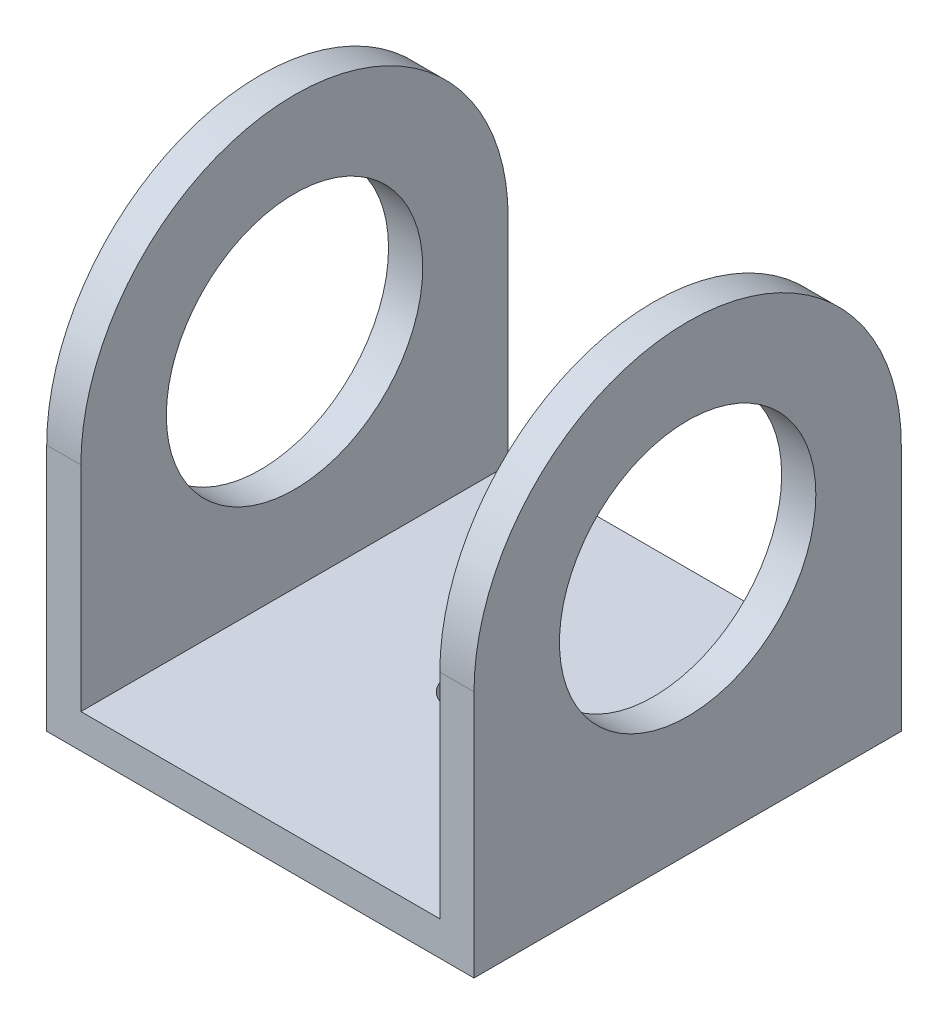
ISO-10303-21;
HEADER;
FILE_DESCRIPTION(('STEP AP214'),'2;1');
FILE_NAME('part.step','',(''),(''),'','','');
FILE_SCHEMA(('AUTOMOTIVE_DESIGN { 1 0 10303 214 1 1 1 1 }'));
ENDSEC;
DATA;
#1=APPLICATION_CONTEXT('core data for automotive mechanical design processes');
#2=APPLICATION_PROTOCOL_DEFINITION('international standard','automotive_design',2000,#1);
#3=PRODUCT_CONTEXT('',#1,'mechanical');
#4=PRODUCT('Part','Part','',(#3));
#5=PRODUCT_RELATED_PRODUCT_CATEGORY('part','',(#4));
#6=PRODUCT_DEFINITION_FORMATION('','',#4);
#7=PRODUCT_DEFINITION_CONTEXT('part definition',#1,'design');
#8=PRODUCT_DEFINITION('design','',#6,#7);
#9=PRODUCT_DEFINITION_SHAPE('','',#8);
#10=(LENGTH_UNIT() NAMED_UNIT(*) SI_UNIT(.MILLI.,.METRE.));
#11=(NAMED_UNIT(*) PLANE_ANGLE_UNIT() SI_UNIT($,.RADIAN.));
#12=(NAMED_UNIT(*) SI_UNIT($,.STERADIAN.) SOLID_ANGLE_UNIT());
#13=UNCERTAINTY_MEASURE_WITH_UNIT(LENGTH_MEASURE(1.E-05),#10,'distance_accuracy_value','');
#14=(GEOMETRIC_REPRESENTATION_CONTEXT(3) GLOBAL_UNCERTAINTY_ASSIGNED_CONTEXT((#13)) GLOBAL_UNIT_ASSIGNED_CONTEXT((#10,
#11,#12)) REPRESENTATION_CONTEXT('',''));
#15=CARTESIAN_POINT('',(0.,0.,0.));
#16=DIRECTION('',(0.,0.,1.));
#17=DIRECTION('',(1.,0.,0.));
#18=AXIS2_PLACEMENT_3D('',#15,#16,#17);
#19=CARTESIAN_POINT('',(25.4,4.064,25.4));
#20=DIRECTION('',(-1.,0.,0.));
#21=DIRECTION('',(0.,0.,1.));
#22=AXIS2_PLACEMENT_3D('',#19,#20,#21);
#23=PLANE('',#22);
#24=CARTESIAN_POINT('',(25.4,29.464,0.));
#25=DIRECTION('',(1.,0.,0.));
#26=DIRECTION('',(0.,0.,-1.));
#27=AXIS2_PLACEMENT_3D('',#24,#25,#26);
#28=CIRCLE('',#27,15.24);
#29=CARTESIAN_POINT('',(25.4,29.464,-15.24));
#30=VERTEX_POINT('',#29);
#31=EDGE_CURVE('E211',#30,#30,#28,.T.);
#32=ORIENTED_EDGE('',*,*,#31,.F.);
#33=EDGE_LOOP('',(#32));
#34=FACE_BOUND('',#33,.T.);
#35=CARTESIAN_POINT('',(25.4,29.464,0.));
#36=DIRECTION('',(-1.,0.,0.));
#37=DIRECTION('',(0.,0.,1.));
#38=AXIS2_PLACEMENT_3D('',#35,#36,#37);
#39=CIRCLE('',#38,25.4);
#40=CARTESIAN_POINT('',(25.4,29.464,25.4));
#41=VERTEX_POINT('',#40);
#42=CARTESIAN_POINT('',(25.4,29.464,-25.4));
#43=VERTEX_POINT('',#42);
#44=EDGE_CURVE('E113',#41,#43,#39,.T.);
#45=ORIENTED_EDGE('',*,*,#44,.F.);
#46=DIRECTION('',(0.,-1.,0.));
#47=VECTOR('',#46,1.);
#48=CARTESIAN_POINT('',(25.4,4.064,25.4));
#49=LINE('',#48,#47);
#50=CARTESIAN_POINT('',(25.4,0.,25.4));
#51=VERTEX_POINT('',#50);
#52=EDGE_CURVE('E126',#41,#51,#49,.T.);
#53=ORIENTED_EDGE('',*,*,#52,.T.);
#54=DIRECTION('',(0.,0.,-1.));
#55=VECTOR('',#54,1.);
#56=CARTESIAN_POINT('',(25.4,0.,25.4));
#57=LINE('',#56,#55);
#58=CARTESIAN_POINT('',(25.4,0.,-25.4));
#59=VERTEX_POINT('',#58);
#60=EDGE_CURVE('E144',#51,#59,#57,.T.);
#61=ORIENTED_EDGE('',*,*,#60,.T.);
#62=DIRECTION('',(0.,-1.,0.));
#63=VECTOR('',#62,1.);
#64=CARTESIAN_POINT('',(25.4,4.064,-25.4));
#65=LINE('',#64,#63);
#66=EDGE_CURVE('E11',#43,#59,#65,.T.);
#67=ORIENTED_EDGE('',*,*,#66,.F.);
#68=EDGE_LOOP('',(#45,#53,#61,#67));
#69=FACE_BOUND('',#68,.T.);
#70=ADVANCED_FACE('F33',(#34,#69),#23,.F.);
#71=CARTESIAN_POINT('',(-25.4,4.064,25.4));
#72=DIRECTION('',(1.,0.,0.));
#73=DIRECTION('',(0.,0.,-1.));
#74=AXIS2_PLACEMENT_3D('',#71,#72,#73);
#75=PLANE('',#74);
#76=CARTESIAN_POINT('',(-25.4,29.464,0.));
#77=DIRECTION('',(1.,0.,0.));
#78=DIRECTION('',(0.,0.,-1.));
#79=AXIS2_PLACEMENT_3D('',#76,#77,#78);
#80=CIRCLE('',#79,15.24);
#81=CARTESIAN_POINT('',(-25.4,29.464,-15.24));
#82=VERTEX_POINT('',#81);
#83=EDGE_CURVE('E164',#82,#82,#80,.T.);
#84=ORIENTED_EDGE('',*,*,#83,.T.);
#85=EDGE_LOOP('',(#84));
#86=FACE_BOUND('',#85,.T.);
#87=DIRECTION('',(0.,-1.,0.));
#88=VECTOR('',#87,1.);
#89=CARTESIAN_POINT('',(-25.4,4.064,25.4));
#90=LINE('',#89,#88);
#91=CARTESIAN_POINT('',(-25.4,29.464,25.4));
#92=VERTEX_POINT('',#91);
#93=CARTESIAN_POINT('',(-25.4,0.,25.4));
#94=VERTEX_POINT('',#93);
#95=EDGE_CURVE('E119',#92,#94,#90,.T.);
#96=ORIENTED_EDGE('',*,*,#95,.F.);
#97=CARTESIAN_POINT('',(-25.4,29.464,0.));
#98=DIRECTION('',(-1.,0.,0.));
#99=DIRECTION('',(0.,0.,1.));
#100=AXIS2_PLACEMENT_3D('',#97,#98,#99);
#101=CIRCLE('',#100,25.4);
#102=CARTESIAN_POINT('',(-25.4,29.464,-25.4));
#103=VERTEX_POINT('',#102);
#104=EDGE_CURVE('E103',#92,#103,#101,.T.);
#105=ORIENTED_EDGE('',*,*,#104,.T.);
#106=DIRECTION('',(0.,-1.,0.));
#107=VECTOR('',#106,1.);
#108=CARTESIAN_POINT('',(-25.4,4.064,-25.4));
#109=LINE('',#108,#107);
#110=CARTESIAN_POINT('',(-25.4,0.,-25.4));
#111=VERTEX_POINT('',#110);
#112=EDGE_CURVE('E42',#103,#111,#109,.T.);
#113=ORIENTED_EDGE('',*,*,#112,.T.);
#114=DIRECTION('',(0.,0.,1.));
#115=VECTOR('',#114,1.);
#116=CARTESIAN_POINT('',(-25.4,0.,25.4));
#117=LINE('',#116,#115);
#118=EDGE_CURVE('E124',#111,#94,#117,.T.);
#119=ORIENTED_EDGE('',*,*,#118,.T.);
#120=EDGE_LOOP('',(#96,#105,#113,#119));
#121=FACE_BOUND('',#120,.T.);
#122=ADVANCED_FACE('F122',(#86,#121),#75,.F.);
#123=CARTESIAN_POINT('',(-21.336,54.864,-25.4));
#124=DIRECTION('',(-1.,0.,0.));
#125=DIRECTION('',(0.,0.,1.));
#126=AXIS2_PLACEMENT_3D('',#123,#124,#125);
#127=PLANE('',#126);
#128=CARTESIAN_POINT('',(-21.336,29.464,0.));
#129=DIRECTION('',(-1.,0.,0.));
#130=DIRECTION('',(0.,0.,1.));
#131=AXIS2_PLACEMENT_3D('',#128,#129,#130);
#132=CIRCLE('',#131,15.24);
#133=CARTESIAN_POINT('',(-21.336,29.464,15.24));
#134=VERTEX_POINT('',#133);
#135=EDGE_CURVE('E163',#134,#134,#132,.T.);
#136=ORIENTED_EDGE('',*,*,#135,.T.);
#137=EDGE_LOOP('',(#136));
#138=FACE_BOUND('',#137,.T.);
#139=CARTESIAN_POINT('',(-21.336,29.464,0.));
#140=DIRECTION('',(-1.,0.,0.));
#141=DIRECTION('',(0.,0.,1.));
#142=AXIS2_PLACEMENT_3D('',#139,#140,#141);
#143=CIRCLE('',#142,25.4);
#144=CARTESIAN_POINT('',(-21.336,29.464,25.4));
#145=VERTEX_POINT('',#144);
#146=CARTESIAN_POINT('',(-21.336,29.464,-25.4));
#147=VERTEX_POINT('',#146);
#148=EDGE_CURVE('E223',#145,#147,#143,.T.);
#149=ORIENTED_EDGE('',*,*,#148,.F.);
#150=DIRECTION('',(0.,-1.,0.));
#151=VECTOR('',#150,1.);
#152=CARTESIAN_POINT('',(-21.336,54.864,25.4));
#153=LINE('',#152,#151);
#154=CARTESIAN_POINT('',(-21.336,4.064,25.4));
#155=VERTEX_POINT('',#154);
#156=EDGE_CURVE('E36',#145,#155,#153,.T.);
#157=ORIENTED_EDGE('',*,*,#156,.T.);
#158=DIRECTION('',(0.,0.,-1.));
#159=VECTOR('',#158,1.);
#160=CARTESIAN_POINT('',(-21.336,4.064,-25.4));
#161=LINE('',#160,#159);
#162=CARTESIAN_POINT('',(-21.336,4.064,-25.4));
#163=VERTEX_POINT('',#162);
#164=EDGE_CURVE('E136',#155,#163,#161,.T.);
#165=ORIENTED_EDGE('',*,*,#164,.T.);
#166=DIRECTION('',(0.,-1.,0.));
#167=VECTOR('',#166,1.);
#168=CARTESIAN_POINT('',(-21.336,54.864,-25.4));
#169=LINE('',#168,#167);
#170=EDGE_CURVE('E165',#147,#163,#169,.T.);
#171=ORIENTED_EDGE('',*,*,#170,.F.);
#172=EDGE_LOOP('',(#149,#157,#165,#171));
#173=FACE_BOUND('',#172,.T.);
#174=ADVANCED_FACE('F205',(#138,#173),#127,.F.);
#175=CARTESIAN_POINT('',(21.336,54.864,-25.4));
#176=DIRECTION('',(1.,0.,0.));
#177=DIRECTION('',(0.,0.,-1.));
#178=AXIS2_PLACEMENT_3D('',#175,#176,#177);
#179=PLANE('',#178);
#180=CARTESIAN_POINT('',(21.336,29.464,0.));
#181=DIRECTION('',(1.,0.,0.));
#182=DIRECTION('',(0.,0.,-1.));
#183=AXIS2_PLACEMENT_3D('',#180,#181,#182);
#184=CIRCLE('',#183,15.24);
#185=CARTESIAN_POINT('',(21.336,29.464,-15.24));
#186=VERTEX_POINT('',#185);
#187=EDGE_CURVE('E161',#186,#186,#184,.T.);
#188=ORIENTED_EDGE('',*,*,#187,.T.);
#189=EDGE_LOOP('',(#188));
#190=FACE_BOUND('',#189,.T.);
#191=DIRECTION('',(0.,-1.,0.));
#192=VECTOR('',#191,1.);
#193=CARTESIAN_POINT('',(21.336,54.864,25.4));
#194=LINE('',#193,#192);
#195=CARTESIAN_POINT('',(21.336,29.464,25.4));
#196=VERTEX_POINT('',#195);
#197=CARTESIAN_POINT('',(21.336,4.064,25.4));
#198=VERTEX_POINT('',#197);
#199=EDGE_CURVE('E58',#196,#198,#194,.T.);
#200=ORIENTED_EDGE('',*,*,#199,.F.);
#201=CARTESIAN_POINT('',(21.336,29.464,0.));
#202=DIRECTION('',(1.,0.,0.));
#203=DIRECTION('',(0.,0.,-1.));
#204=AXIS2_PLACEMENT_3D('',#201,#202,#203);
#205=CIRCLE('',#204,25.4);
#206=CARTESIAN_POINT('',(21.336,29.464,-25.4));
#207=VERTEX_POINT('',#206);
#208=EDGE_CURVE('E218',#207,#196,#205,.T.);
#209=ORIENTED_EDGE('',*,*,#208,.F.);
#210=DIRECTION('',(0.,-1.,0.));
#211=VECTOR('',#210,1.);
#212=CARTESIAN_POINT('',(21.336,54.864,-25.4));
#213=LINE('',#212,#211);
#214=CARTESIAN_POINT('',(21.336,4.064,-25.4));
#215=VERTEX_POINT('',#214);
#216=EDGE_CURVE('E50',#207,#215,#213,.T.);
#217=ORIENTED_EDGE('',*,*,#216,.T.);
#218=DIRECTION('',(0.,0.,1.));
#219=VECTOR('',#218,1.);
#220=CARTESIAN_POINT('',(21.336,4.064,-25.4));
#221=LINE('',#220,#219);
#222=EDGE_CURVE('E172',#215,#198,#221,.T.);
#223=ORIENTED_EDGE('',*,*,#222,.T.);
#224=EDGE_LOOP('',(#200,#209,#217,#223));
#225=FACE_BOUND('',#224,.T.);
#226=ADVANCED_FACE('F229',(#190,#225),#179,.F.);
#227=CARTESIAN_POINT('',(-25.4,4.064,-25.4));
#228=DIRECTION('',(0.,0.,1.));
#229=DIRECTION('',(1.,0.,0.));
#230=AXIS2_PLACEMENT_3D('',#227,#228,#229);
#231=PLANE('',#230);
#232=DIRECTION('',(-1.,0.,0.));
#233=VECTOR('',#232,1.);
#234=CARTESIAN_POINT('',(25.4,29.464,-25.4));
#235=LINE('',#234,#233);
#236=EDGE_CURVE('E220',#43,#207,#235,.T.);
#237=ORIENTED_EDGE('',*,*,#236,.F.);
#238=ORIENTED_EDGE('',*,*,#66,.T.);
#239=DIRECTION('',(-1.,0.,0.));
#240=VECTOR('',#239,1.);
#241=CARTESIAN_POINT('',(-25.4,0.,-25.4));
#242=LINE('',#241,#240);
#243=EDGE_CURVE('E147',#59,#111,#242,.T.);
#244=ORIENTED_EDGE('',*,*,#243,.T.);
#245=ORIENTED_EDGE('',*,*,#112,.F.);
#246=EDGE_CURVE('E109',#147,#103,#235,.T.);
#247=ORIENTED_EDGE('',*,*,#246,.F.);
#248=ORIENTED_EDGE('',*,*,#170,.T.);
#249=DIRECTION('',(-1.,0.,0.));
#250=VECTOR('',#249,1.);
#251=CARTESIAN_POINT('',(-25.4,4.064,-25.4));
#252=LINE('',#251,#250);
#253=EDGE_CURVE('E135',#215,#163,#252,.T.);
#254=ORIENTED_EDGE('',*,*,#253,.F.);
#255=ORIENTED_EDGE('',*,*,#216,.F.);
#256=EDGE_LOOP('',(#237,#238,#244,#245,#247,#248,#254,#255));
#257=FACE_BOUND('',#256,.T.);
#258=ADVANCED_FACE('F231',(#257),#231,.F.);
#259=CARTESIAN_POINT('',(0.,4.064,0.));
#260=DIRECTION('',(0.,-1.,0.));
#261=DIRECTION('',(0.,0.,-1.));
#262=AXIS2_PLACEMENT_3D('',#259,#260,#261);
#263=PLANE('',#262);
#264=CARTESIAN_POINT('',(0.,4.064,0.));
#265=DIRECTION('',(0.,1.,0.));
#266=DIRECTION('',(0.,0.,1.));
#267=AXIS2_PLACEMENT_3D('',#264,#265,#266);
#268=CIRCLE('',#267,3.175);
#269=CARTESIAN_POINT('',(0.,4.064,3.175));
#270=VERTEX_POINT('',#269);
#271=EDGE_CURVE('E148',#270,#270,#268,.T.);
#272=ORIENTED_EDGE('',*,*,#271,.F.);
#273=EDGE_LOOP('',(#272));
#274=FACE_BOUND('',#273,.T.);
#275=ORIENTED_EDGE('',*,*,#222,.F.);
#276=ORIENTED_EDGE('',*,*,#253,.T.);
#277=ORIENTED_EDGE('',*,*,#164,.F.);
#278=DIRECTION('',(1.,0.,0.));
#279=VECTOR('',#278,1.);
#280=CARTESIAN_POINT('',(-25.4,4.064,25.4));
#281=LINE('',#280,#279);
#282=EDGE_CURVE('E129',#155,#198,#281,.T.);
#283=ORIENTED_EDGE('',*,*,#282,.T.);
#284=EDGE_LOOP('',(#275,#276,#277,#283));
#285=FACE_BOUND('',#284,.T.);
#286=ADVANCED_FACE('F230',(#274,#285),#263,.F.);
#287=CARTESIAN_POINT('',(0.,0.,0.));
#288=DIRECTION('',(0.,-1.,0.));
#289=DIRECTION('',(0.,0.,-1.));
#290=AXIS2_PLACEMENT_3D('',#287,#288,#289);
#291=PLANE('',#290);
#292=ORIENTED_EDGE('',*,*,#60,.F.);
#293=DIRECTION('',(1.,0.,0.));
#294=VECTOR('',#293,1.);
#295=CARTESIAN_POINT('',(-25.4,0.,25.4));
#296=LINE('',#295,#294);
#297=EDGE_CURVE('E151',#94,#51,#296,.T.);
#298=ORIENTED_EDGE('',*,*,#297,.F.);
#299=ORIENTED_EDGE('',*,*,#118,.F.);
#300=ORIENTED_EDGE('',*,*,#243,.F.);
#301=EDGE_LOOP('',(#292,#298,#299,#300));
#302=FACE_BOUND('',#301,.T.);
#303=CARTESIAN_POINT('',(0.,0.,0.));
#304=DIRECTION('',(0.,1.,0.));
#305=DIRECTION('',(0.,0.,1.));
#306=AXIS2_PLACEMENT_3D('',#303,#304,#305);
#307=CIRCLE('',#306,3.175);
#308=CARTESIAN_POINT('',(0.,0.,3.175));
#309=VERTEX_POINT('',#308);
#310=EDGE_CURVE('E169',#309,#309,#307,.T.);
#311=ORIENTED_EDGE('',*,*,#310,.T.);
#312=EDGE_LOOP('',(#311));
#313=FACE_BOUND('',#312,.T.);
#314=ADVANCED_FACE('F181',(#302,#313),#291,.T.);
#315=CARTESIAN_POINT('',(-25.4,4.064,25.4));
#316=DIRECTION('',(0.,0.,-1.));
#317=DIRECTION('',(-1.,0.,0.));
#318=AXIS2_PLACEMENT_3D('',#315,#316,#317);
#319=PLANE('',#318);
#320=ORIENTED_EDGE('',*,*,#52,.F.);
#321=DIRECTION('',(-1.,0.,0.));
#322=VECTOR('',#321,1.);
#323=CARTESIAN_POINT('',(25.4,29.464,25.4));
#324=LINE('',#323,#322);
#325=EDGE_CURVE('E114',#41,#196,#324,.T.);
#326=ORIENTED_EDGE('',*,*,#325,.T.);
#327=ORIENTED_EDGE('',*,*,#199,.T.);
#328=ORIENTED_EDGE('',*,*,#282,.F.);
#329=ORIENTED_EDGE('',*,*,#156,.F.);
#330=EDGE_CURVE('E106',#145,#92,#324,.T.);
#331=ORIENTED_EDGE('',*,*,#330,.T.);
#332=ORIENTED_EDGE('',*,*,#95,.T.);
#333=ORIENTED_EDGE('',*,*,#297,.T.);
#334=EDGE_LOOP('',(#320,#326,#327,#328,#329,#331,#332,#333));
#335=FACE_BOUND('',#334,.T.);
#336=ADVANCED_FACE('F117',(#335),#319,.F.);
#337=CARTESIAN_POINT('',(0.,4.064,0.));
#338=DIRECTION('',(0.,-1.,0.));
#339=DIRECTION('',(0.,0.,-1.));
#340=AXIS2_PLACEMENT_3D('',#337,#338,#339);
#341=CYLINDRICAL_SURFACE('',#340,3.175);
#342=ORIENTED_EDGE('',*,*,#271,.T.);
#343=EDGE_LOOP('',(#342));
#344=FACE_BOUND('',#343,.T.);
#345=ORIENTED_EDGE('',*,*,#310,.F.);
#346=EDGE_LOOP('',(#345));
#347=FACE_BOUND('',#346,.T.);
#348=ADVANCED_FACE('F183',(#344,#347),#341,.F.);
#349=CARTESIAN_POINT('',(-25.4,29.464,0.));
#350=DIRECTION('',(1.,0.,0.));
#351=DIRECTION('',(0.,0.,-1.));
#352=AXIS2_PLACEMENT_3D('',#349,#350,#351);
#353=CYLINDRICAL_SURFACE('',#352,15.24);
#354=ORIENTED_EDGE('',*,*,#31,.T.);
#355=EDGE_LOOP('',(#354));
#356=FACE_BOUND('',#355,.T.);
#357=ORIENTED_EDGE('',*,*,#187,.F.);
#358=EDGE_LOOP('',(#357));
#359=FACE_BOUND('',#358,.T.);
#360=ADVANCED_FACE('F185',(#356,#359),#353,.F.);
#361=ORIENTED_EDGE('',*,*,#83,.F.);
#362=EDGE_LOOP('',(#361));
#363=FACE_BOUND('',#362,.T.);
#364=ORIENTED_EDGE('',*,*,#135,.F.);
#365=EDGE_LOOP('',(#364));
#366=FACE_BOUND('',#365,.T.);
#367=ADVANCED_FACE('F192',(#363,#366),#353,.F.);
#368=CARTESIAN_POINT('',(25.4,29.464,0.));
#369=DIRECTION('',(-1.,0.,0.));
#370=DIRECTION('',(0.,0.,1.));
#371=AXIS2_PLACEMENT_3D('',#368,#369,#370);
#372=CYLINDRICAL_SURFACE('',#371,25.4);
#373=ORIENTED_EDGE('',*,*,#208,.T.);
#374=ORIENTED_EDGE('',*,*,#325,.F.);
#375=ORIENTED_EDGE('',*,*,#44,.T.);
#376=ORIENTED_EDGE('',*,*,#236,.T.);
#377=EDGE_LOOP('',(#373,#374,#375,#376));
#378=FACE_BOUND('',#377,.T.);
#379=ADVANCED_FACE('F217',(#378),#372,.T.);
#380=ORIENTED_EDGE('',*,*,#148,.T.);
#381=ORIENTED_EDGE('',*,*,#246,.T.);
#382=ORIENTED_EDGE('',*,*,#104,.F.);
#383=ORIENTED_EDGE('',*,*,#330,.F.);
#384=EDGE_LOOP('',(#380,#381,#382,#383));
#385=FACE_BOUND('',#384,.T.);
#386=ADVANCED_FACE('F105',(#385),#372,.T.);
#387=CLOSED_SHELL('',(#70,#122,#174,#226,#258,#286,#314,#336,#348,#360,#367,#379,#386));
#388=MANIFOLD_SOLID_BREP('B2',#387);
#389=ADVANCED_BREP_SHAPE_REPRESENTATION('',(#18,#388),#14);
#390=SHAPE_DEFINITION_REPRESENTATION(#9,#389);
ENDSEC;
END-ISO-10303-21;
